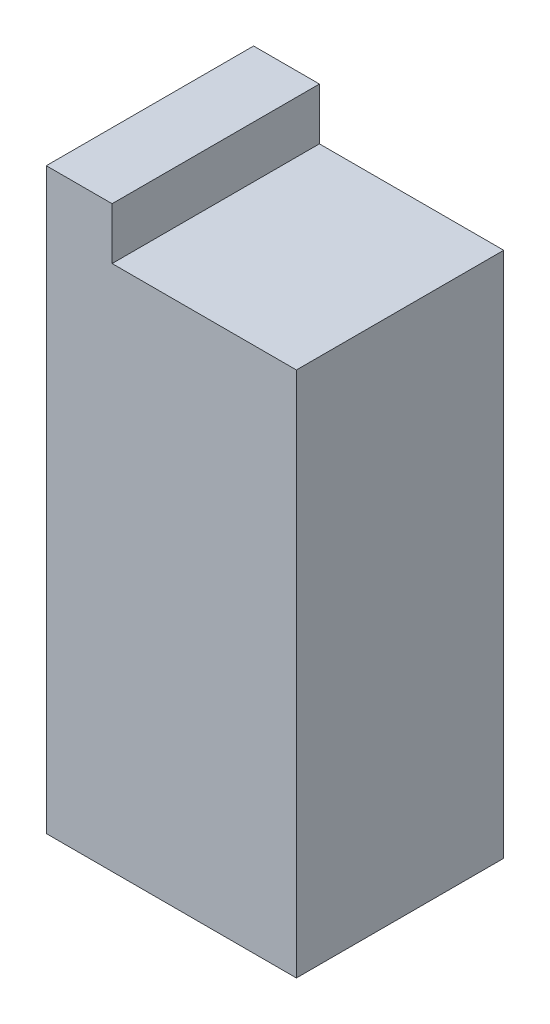
ISO-10303-21;
HEADER;
FILE_DESCRIPTION(('STEP AP214'),'2;1');
FILE_NAME('part.step','',(''),(''),'','','');
FILE_SCHEMA(('AUTOMOTIVE_DESIGN { 1 0 10303 214 1 1 1 1 }'));
ENDSEC;
DATA;
#1=APPLICATION_CONTEXT('core data for automotive mechanical design processes');
#2=APPLICATION_PROTOCOL_DEFINITION('international standard','automotive_design',2000,#1);
#3=PRODUCT_CONTEXT('',#1,'mechanical');
#4=PRODUCT('Part','Part','',(#3));
#5=PRODUCT_RELATED_PRODUCT_CATEGORY('part','',(#4));
#6=PRODUCT_DEFINITION_FORMATION('','',#4);
#7=PRODUCT_DEFINITION_CONTEXT('part definition',#1,'design');
#8=PRODUCT_DEFINITION('design','',#6,#7);
#9=PRODUCT_DEFINITION_SHAPE('','',#8);
#10=(LENGTH_UNIT() NAMED_UNIT(*) SI_UNIT(.MILLI.,.METRE.));
#11=(NAMED_UNIT(*) PLANE_ANGLE_UNIT() SI_UNIT($,.RADIAN.));
#12=(NAMED_UNIT(*) SI_UNIT($,.STERADIAN.) SOLID_ANGLE_UNIT());
#13=UNCERTAINTY_MEASURE_WITH_UNIT(LENGTH_MEASURE(1.E-05),#10,'distance_accuracy_value','');
#14=(GEOMETRIC_REPRESENTATION_CONTEXT(3) GLOBAL_UNCERTAINTY_ASSIGNED_CONTEXT((#13)) GLOBAL_UNIT_ASSIGNED_CONTEXT((#10,
#11,#12)) REPRESENTATION_CONTEXT('',''));
#15=CARTESIAN_POINT('',(0.,0.,0.));
#16=DIRECTION('',(0.,0.,1.));
#17=DIRECTION('',(1.,0.,0.));
#18=AXIS2_PLACEMENT_3D('',#15,#16,#17);
#19=CARTESIAN_POINT('',(8.89,-25.4,10.));
#20=DIRECTION('',(-1.,0.,0.));
#21=DIRECTION('',(0.,0.,1.));
#22=AXIS2_PLACEMENT_3D('',#19,#20,#21);
#23=PLANE('',#22);
#24=DIRECTION('',(0.,1.,0.));
#25=VECTOR('',#24,1.);
#26=CARTESIAN_POINT('',(8.89,-25.4,-10.));
#27=LINE('',#26,#25);
#28=CARTESIAN_POINT('',(8.89,-25.4,-10.));
#29=VERTEX_POINT('',#28);
#30=CARTESIAN_POINT('',(8.89,25.4,-10.));
#31=VERTEX_POINT('',#30);
#32=EDGE_CURVE('E129',#29,#31,#27,.T.);
#33=ORIENTED_EDGE('',*,*,#32,.T.);
#34=DIRECTION('',(0.,0.,-1.));
#35=VECTOR('',#34,1.);
#36=CARTESIAN_POINT('',(8.89,25.4,10.));
#37=LINE('',#36,#35);
#38=CARTESIAN_POINT('',(8.89,25.4,10.));
#39=VERTEX_POINT('',#38);
#40=EDGE_CURVE('E11',#39,#31,#37,.T.);
#41=ORIENTED_EDGE('',*,*,#40,.F.);
#42=DIRECTION('',(0.,1.,0.));
#43=VECTOR('',#42,1.);
#44=CARTESIAN_POINT('',(8.89,-25.4,10.));
#45=LINE('',#44,#43);
#46=CARTESIAN_POINT('',(8.89,-25.4,10.));
#47=VERTEX_POINT('',#46);
#48=EDGE_CURVE('E146',#47,#39,#45,.T.);
#49=ORIENTED_EDGE('',*,*,#48,.F.);
#50=DIRECTION('',(0.,0.,-1.));
#51=VECTOR('',#50,1.);
#52=CARTESIAN_POINT('',(8.89,-25.4,10.));
#53=LINE('',#52,#51);
#54=EDGE_CURVE('E125',#47,#29,#53,.T.);
#55=ORIENTED_EDGE('',*,*,#54,.T.);
#56=EDGE_LOOP('',(#33,#41,#49,#55));
#57=FACE_BOUND('',#56,.T.);
#58=ADVANCED_FACE('F39',(#57),#23,.F.);
#59=CARTESIAN_POINT('',(-8.89,25.4,10.));
#60=DIRECTION('',(0.,-1.,0.));
#61=DIRECTION('',(0.,0.,-1.));
#62=AXIS2_PLACEMENT_3D('',#59,#60,#61);
#63=PLANE('',#62);
#64=DIRECTION('',(-1.,0.,0.));
#65=VECTOR('',#64,1.);
#66=CARTESIAN_POINT('',(-8.89,25.4,-10.));
#67=LINE('',#66,#65);
#68=CARTESIAN_POINT('',(-8.89,25.4,-10.));
#69=VERTEX_POINT('',#68);
#70=EDGE_CURVE('E133',#31,#69,#67,.T.);
#71=ORIENTED_EDGE('',*,*,#70,.T.);
#72=DIRECTION('',(0.,0.,-1.));
#73=VECTOR('',#72,1.);
#74=CARTESIAN_POINT('',(-8.89,25.4,10.));
#75=LINE('',#74,#73);
#76=CARTESIAN_POINT('',(-8.89,25.4,10.));
#77=VERTEX_POINT('',#76);
#78=EDGE_CURVE('E48',#77,#69,#75,.T.);
#79=ORIENTED_EDGE('',*,*,#78,.F.);
#80=DIRECTION('',(-1.,0.,0.));
#81=VECTOR('',#80,1.);
#82=CARTESIAN_POINT('',(-8.89,25.4,10.));
#83=LINE('',#82,#81);
#84=EDGE_CURVE('E91',#39,#77,#83,.T.);
#85=ORIENTED_EDGE('',*,*,#84,.F.);
#86=ORIENTED_EDGE('',*,*,#40,.T.);
#87=EDGE_LOOP('',(#71,#79,#85,#86));
#88=FACE_BOUND('',#87,.T.);
#89=ADVANCED_FACE('F167',(#88),#63,.F.);
#90=CARTESIAN_POINT('',(-8.89,25.4,10.));
#91=DIRECTION('',(-1.,0.,0.));
#92=DIRECTION('',(0.,0.,1.));
#93=AXIS2_PLACEMENT_3D('',#90,#91,#92);
#94=PLANE('',#93);
#95=DIRECTION('',(0.,1.,0.));
#96=VECTOR('',#95,1.);
#97=CARTESIAN_POINT('',(-8.89,25.4,-10.));
#98=LINE('',#97,#96);
#99=CARTESIAN_POINT('',(-8.89,30.4,-10.));
#100=VERTEX_POINT('',#99);
#101=EDGE_CURVE('E136',#69,#100,#98,.T.);
#102=ORIENTED_EDGE('',*,*,#101,.T.);
#103=DIRECTION('',(0.,0.,-1.));
#104=VECTOR('',#103,1.);
#105=CARTESIAN_POINT('',(-8.89,30.4,10.));
#106=LINE('',#105,#104);
#107=CARTESIAN_POINT('',(-8.89,30.4,10.));
#108=VERTEX_POINT('',#107);
#109=EDGE_CURVE('E118',#108,#100,#106,.T.);
#110=ORIENTED_EDGE('',*,*,#109,.F.);
#111=DIRECTION('',(0.,1.,0.));
#112=VECTOR('',#111,1.);
#113=CARTESIAN_POINT('',(-8.89,25.4,10.));
#114=LINE('',#113,#112);
#115=EDGE_CURVE('E105',#77,#108,#114,.T.);
#116=ORIENTED_EDGE('',*,*,#115,.F.);
#117=ORIENTED_EDGE('',*,*,#78,.T.);
#118=EDGE_LOOP('',(#102,#110,#116,#117));
#119=FACE_BOUND('',#118,.T.);
#120=ADVANCED_FACE('F156',(#119),#94,.F.);
#121=CARTESIAN_POINT('',(-8.89,30.4,10.));
#122=DIRECTION('',(0.,-1.,0.));
#123=DIRECTION('',(1.,0.,0.));
#124=AXIS2_PLACEMENT_3D('',#121,#122,#123);
#125=PLANE('',#124);
#126=DIRECTION('',(-1.,0.,0.));
#127=VECTOR('',#126,1.);
#128=CARTESIAN_POINT('',(-8.89,30.4,-10.));
#129=LINE('',#128,#127);
#130=CARTESIAN_POINT('',(-15.24,30.4,-10.));
#131=VERTEX_POINT('',#130);
#132=EDGE_CURVE('E115',#100,#131,#129,.T.);
#133=ORIENTED_EDGE('',*,*,#132,.T.);
#134=DIRECTION('',(0.,0.,-1.));
#135=VECTOR('',#134,1.);
#136=CARTESIAN_POINT('',(-15.24,30.4,10.));
#137=LINE('',#136,#135);
#138=CARTESIAN_POINT('',(-15.24,30.4,10.));
#139=VERTEX_POINT('',#138);
#140=EDGE_CURVE('E112',#139,#131,#137,.T.);
#141=ORIENTED_EDGE('',*,*,#140,.F.);
#142=DIRECTION('',(-1.,0.,0.));
#143=VECTOR('',#142,1.);
#144=CARTESIAN_POINT('',(-8.89,30.4,10.));
#145=LINE('',#144,#143);
#146=EDGE_CURVE('E98',#108,#139,#145,.T.);
#147=ORIENTED_EDGE('',*,*,#146,.F.);
#148=ORIENTED_EDGE('',*,*,#109,.T.);
#149=EDGE_LOOP('',(#133,#141,#147,#148));
#150=FACE_BOUND('',#149,.T.);
#151=ADVANCED_FACE('F113',(#150),#125,.F.);
#152=CARTESIAN_POINT('',(-15.24,-25.4,10.));
#153=DIRECTION('',(1.,0.,0.));
#154=DIRECTION('',(0.,0.,-1.));
#155=AXIS2_PLACEMENT_3D('',#152,#153,#154);
#156=PLANE('',#155);
#157=DIRECTION('',(0.,-1.,0.));
#158=VECTOR('',#157,1.);
#159=CARTESIAN_POINT('',(-15.24,-25.4,-10.));
#160=LINE('',#159,#158);
#161=CARTESIAN_POINT('',(-15.24,-25.4,-10.));
#162=VERTEX_POINT('',#161);
#163=EDGE_CURVE('E141',#131,#162,#160,.T.);
#164=ORIENTED_EDGE('',*,*,#163,.T.);
#165=DIRECTION('',(0.,0.,-1.));
#166=VECTOR('',#165,1.);
#167=CARTESIAN_POINT('',(-15.24,-25.4,10.));
#168=LINE('',#167,#166);
#169=CARTESIAN_POINT('',(-15.24,-25.4,10.));
#170=VERTEX_POINT('',#169);
#171=EDGE_CURVE('E119',#170,#162,#168,.T.);
#172=ORIENTED_EDGE('',*,*,#171,.F.);
#173=DIRECTION('',(0.,-1.,0.));
#174=VECTOR('',#173,1.);
#175=CARTESIAN_POINT('',(-15.24,-25.4,10.));
#176=LINE('',#175,#174);
#177=EDGE_CURVE('E102',#139,#170,#176,.T.);
#178=ORIENTED_EDGE('',*,*,#177,.F.);
#179=ORIENTED_EDGE('',*,*,#140,.T.);
#180=EDGE_LOOP('',(#164,#172,#178,#179));
#181=FACE_BOUND('',#180,.T.);
#182=ADVANCED_FACE('F121',(#181),#156,.F.);
#183=CARTESIAN_POINT('',(-8.89,-25.4,10.));
#184=DIRECTION('',(0.,1.,0.));
#185=DIRECTION('',(0.,0.,1.));
#186=AXIS2_PLACEMENT_3D('',#183,#184,#185);
#187=PLANE('',#186);
#188=DIRECTION('',(1.,0.,0.));
#189=VECTOR('',#188,1.);
#190=CARTESIAN_POINT('',(-8.89,-25.4,-10.));
#191=LINE('',#190,#189);
#192=EDGE_CURVE('E79',#162,#29,#191,.T.);
#193=ORIENTED_EDGE('',*,*,#192,.T.);
#194=ORIENTED_EDGE('',*,*,#54,.F.);
#195=DIRECTION('',(1.,0.,0.));
#196=VECTOR('',#195,1.);
#197=CARTESIAN_POINT('',(-8.89,-25.4,10.));
#198=LINE('',#197,#196);
#199=EDGE_CURVE('E56',#170,#47,#198,.T.);
#200=ORIENTED_EDGE('',*,*,#199,.F.);
#201=ORIENTED_EDGE('',*,*,#171,.T.);
#202=EDGE_LOOP('',(#193,#194,#200,#201));
#203=FACE_BOUND('',#202,.T.);
#204=ADVANCED_FACE('F158',(#203),#187,.F.);
#205=CARTESIAN_POINT('',(0.,0.,10.));
#206=DIRECTION('',(0.,0.,-1.));
#207=DIRECTION('',(-1.,0.,0.));
#208=AXIS2_PLACEMENT_3D('',#205,#206,#207);
#209=PLANE('',#208);
#210=ORIENTED_EDGE('',*,*,#48,.T.);
#211=ORIENTED_EDGE('',*,*,#84,.T.);
#212=ORIENTED_EDGE('',*,*,#115,.T.);
#213=ORIENTED_EDGE('',*,*,#146,.T.);
#214=ORIENTED_EDGE('',*,*,#177,.T.);
#215=ORIENTED_EDGE('',*,*,#199,.T.);
#216=EDGE_LOOP('',(#210,#211,#212,#213,#214,#215));
#217=FACE_BOUND('',#216,.T.);
#218=ADVANCED_FACE('F100',(#217),#209,.F.);
#219=CARTESIAN_POINT('',(0.,0.,-10.));
#220=DIRECTION('',(0.,0.,-1.));
#221=DIRECTION('',(-1.,0.,0.));
#222=AXIS2_PLACEMENT_3D('',#219,#220,#221);
#223=PLANE('',#222);
#224=ORIENTED_EDGE('',*,*,#32,.F.);
#225=ORIENTED_EDGE('',*,*,#192,.F.);
#226=ORIENTED_EDGE('',*,*,#163,.F.);
#227=ORIENTED_EDGE('',*,*,#132,.F.);
#228=ORIENTED_EDGE('',*,*,#101,.F.);
#229=ORIENTED_EDGE('',*,*,#70,.F.);
#230=EDGE_LOOP('',(#224,#225,#226,#227,#228,#229));
#231=FACE_BOUND('',#230,.T.);
#232=ADVANCED_FACE('F157',(#231),#223,.T.);
#233=CLOSED_SHELL('',(#58,#89,#120,#151,#182,#204,#218,#232));
#234=MANIFOLD_SOLID_BREP('B2',#233);
#235=ADVANCED_BREP_SHAPE_REPRESENTATION('',(#18,#234),#14);
#236=SHAPE_DEFINITION_REPRESENTATION(#9,#235);
ENDSEC;
END-ISO-10303-21;
